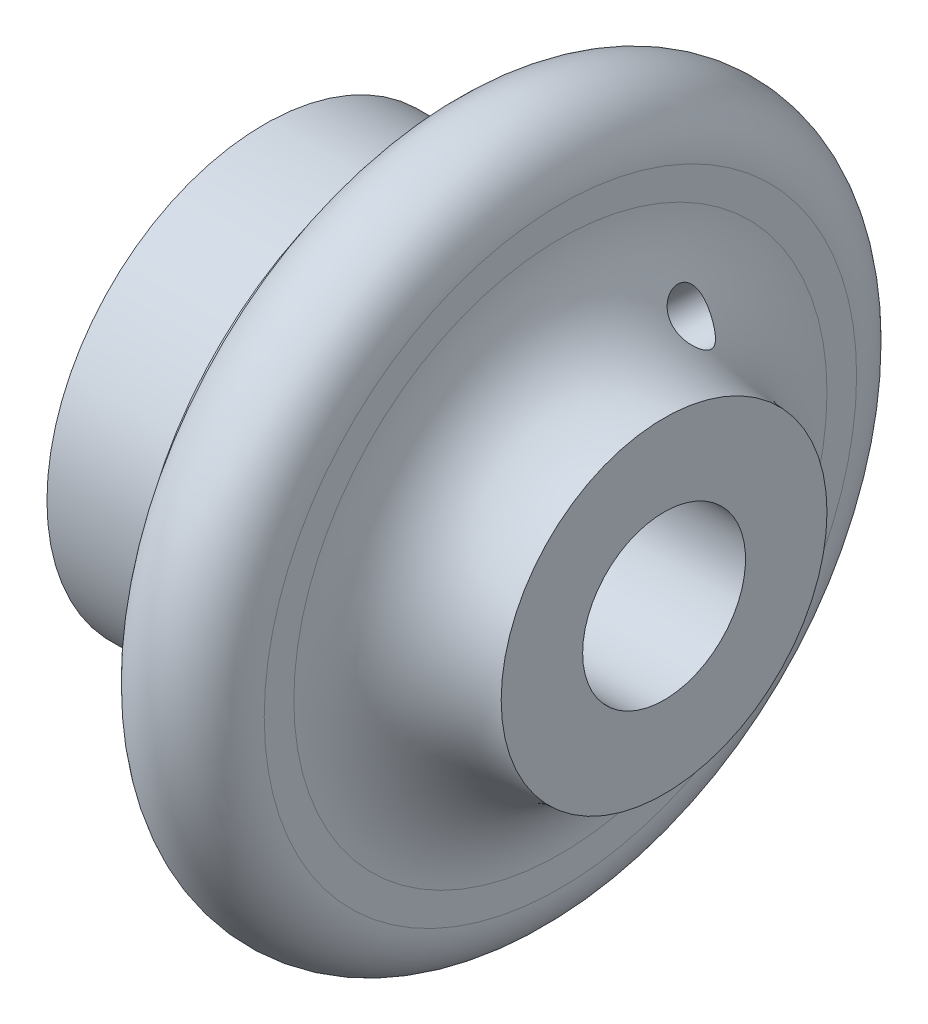
ISO-10303-21;
HEADER;
FILE_DESCRIPTION(('STEP AP214'),'2;1');
FILE_NAME('part.step','',(''),(''),'','','');
FILE_SCHEMA(('AUTOMOTIVE_DESIGN { 1 0 10303 214 1 1 1 1 }'));
ENDSEC;
DATA;
#1=APPLICATION_CONTEXT('core data for automotive mechanical design processes');
#2=APPLICATION_PROTOCOL_DEFINITION('international standard','automotive_design',2000,#1);
#3=PRODUCT_CONTEXT('',#1,'mechanical');
#4=PRODUCT('Part','Part','',(#3));
#5=PRODUCT_RELATED_PRODUCT_CATEGORY('part','',(#4));
#6=PRODUCT_DEFINITION_FORMATION('','',#4);
#7=PRODUCT_DEFINITION_CONTEXT('part definition',#1,'design');
#8=PRODUCT_DEFINITION('design','',#6,#7);
#9=PRODUCT_DEFINITION_SHAPE('','',#8);
#10=(LENGTH_UNIT() NAMED_UNIT(*) SI_UNIT(.MILLI.,.METRE.));
#11=(NAMED_UNIT(*) PLANE_ANGLE_UNIT() SI_UNIT($,.RADIAN.));
#12=(NAMED_UNIT(*) SI_UNIT($,.STERADIAN.) SOLID_ANGLE_UNIT());
#13=UNCERTAINTY_MEASURE_WITH_UNIT(LENGTH_MEASURE(1.E-05),#10,'distance_accuracy_value','');
#14=(GEOMETRIC_REPRESENTATION_CONTEXT(3) GLOBAL_UNCERTAINTY_ASSIGNED_CONTEXT((#13)) GLOBAL_UNIT_ASSIGNED_CONTEXT((#10,
#11,#12)) REPRESENTATION_CONTEXT('',''));
#15=CARTESIAN_POINT('',(0.,0.,0.));
#16=DIRECTION('',(0.,0.,1.));
#17=DIRECTION('',(1.,0.,0.));
#18=AXIS2_PLACEMENT_3D('',#15,#16,#17);
#19=CARTESIAN_POINT('',(0.,0.,0.));
#20=DIRECTION('',(-1.,0.,0.));
#21=DIRECTION('',(0.,0.,1.));
#22=AXIS2_PLACEMENT_3D('',#19,#20,#21);
#23=CYLINDRICAL_SURFACE('',#22,5.5);
#24=CARTESIAN_POINT('',(12.5844462418206,4.68197479093069,-2.88602010684083));
#25=CARTESIAN_POINT('',(12.5844073538159,4.68356159719157,-2.88344583971184));
#26=CARTESIAN_POINT('',(12.5843733260485,4.68514631308939,-2.88087021063567));
#27=CARTESIAN_POINT('',(12.5843149929826,4.6883114940928,-2.87571634191222));
#28=CARTESIAN_POINT('',(12.5842906873826,4.68989195932865,-2.87313810234836));
#29=CARTESIAN_POINT('',(12.5842517986359,4.6930486347125,-2.86797901966672));
#30=CARTESIAN_POINT('',(12.5842372152882,4.69462484494777,-2.86539817660388));
#31=CARTESIAN_POINT('',(12.5842177709226,4.69777300609527,-2.86023389398206));
#32=CARTESIAN_POINT('',(12.5842129098042,4.69934495705135,-2.85765045445021));
#33=CARTESIAN_POINT('',(12.5842129098042,4.7024845954034,-2.85248098594489));
#34=CARTESIAN_POINT('',(12.5842177709226,4.70405228279937,-2.84989495697142));
#35=CARTESIAN_POINT('',(12.5842372152882,4.70718338981338,-2.84472031664813));
#36=CARTESIAN_POINT('',(12.5842517986359,4.70874680938714,-2.8421317052719));
#37=CARTESIAN_POINT('',(12.5842906873826,4.71186937653598,-2.83695190720673));
#38=CARTESIAN_POINT('',(12.5843149929826,4.71342852402208,-2.83436072046567));
#39=CARTESIAN_POINT('',(12.5843733260485,4.71654254283953,-2.82917577876808));
#40=CARTESIAN_POINT('',(12.5844073538159,4.7180974140368,-2.8265820237344));
#41=CARTESIAN_POINT('',(12.5844462418206,4.71965011289547,-2.82398704172768));
#42=B_SPLINE_CURVE_WITH_KNOTS('',3,(#24,#25,#26,#27,#28,#29,#30,#31,#32,#33,#34,#35,#36,#37,#38,
#39,#40,#41),.UNSPECIFIED.,.F.,.F.,(4,2,2,2,2,2,2,2,4),(0.,0.00907285893690582,
0.018145436584956,0.0272178267022607,0.0362901230527381,0.0453624194032134,0.0544348095205164,
0.0635073871685684,0.0725802461054741),.UNSPECIFIED.);
#43=CARTESIAN_POINT('',(12.5844462418206,4.68197479093069,-2.88602010684082));
#44=VERTEX_POINT('',#43);
#45=CARTESIAN_POINT('',(12.5844462418206,4.71965011289547,-2.82398704172767));
#46=VERTEX_POINT('',#45);
#47=EDGE_CURVE('E11',#44,#46,#42,.T.);
#48=ORIENTED_EDGE('',*,*,#47,.T.);
#49=CARTESIAN_POINT('',(12.5844462418206,4.71965011289567,-2.82398704172733));
#50=CARTESIAN_POINT('',(12.5854407243061,4.74254446188668,-2.78573431152862));
#51=CARTESIAN_POINT('',(12.5882853164809,4.76494222822375,-2.74723618103867));
#52=CARTESIAN_POINT('',(12.5976312896019,4.8086131869956,-2.67005435174031));
#53=CARTESIAN_POINT('',(12.6041320860646,4.8298865585824,-2.63137068357183));
#54=CARTESIAN_POINT('',(12.620726193613,4.8711320529324,-2.55420911979931));
#55=CARTESIAN_POINT('',(12.6308102996465,4.89110735616467,-2.51573095101142));
#56=CARTESIAN_POINT('',(12.6544856142854,4.929721102333,-2.43919875473313));
#57=CARTESIAN_POINT('',(12.6680768440965,4.94835953718481,-2.40114472980877));
#58=CARTESIAN_POINT('',(12.7139696256757,5.00216415963477,-2.28807572565284));
#59=CARTESIAN_POINT('',(12.751405576397,5.03525720113143,-2.2140830078222));
#60=CARTESIAN_POINT('',(12.8387197184371,5.09564614568706,-2.07133381965437));
#61=CARTESIAN_POINT('',(12.8885997084428,5.12294120963757,-2.00257810816176));
#62=CARTESIAN_POINT('',(13.0005839574179,5.17261700326746,-1.87059685722941));
#63=CARTESIAN_POINT('',(13.0629609143852,5.19485893209347,-1.807550950142));
#64=CARTESIAN_POINT('',(13.1970813107076,5.23412805334419,-1.6904814208555));
#65=CARTESIAN_POINT('',(13.2688281183622,5.25115336308427,-1.6364610591783));
#66=CARTESIAN_POINT('',(13.4269159007863,5.28219590895888,-1.53348855892508));
#67=CARTESIAN_POINT('',(13.5139976658711,5.29575901791654,-1.48554162100251));
#68=CARTESIAN_POINT('',(13.694271640001,5.31855938831596,-1.40171395675281));
#69=CARTESIAN_POINT('',(13.7874672630901,5.32779420894784,-1.36584004185616));
#70=CARTESIAN_POINT('',(14.0256302253669,5.3466400021188,-1.29061383483072));
#71=CARTESIAN_POINT('',(14.1730832041622,5.35410874261513,-1.2585698453349));
#72=CARTESIAN_POINT('',(14.4714718393643,5.36348989762759,-1.21793558824287));
#73=CARTESIAN_POINT('',(14.6224153706091,5.36538819150762,-1.20940492836748));
#74=CARTESIAN_POINT('',(14.8720292179564,5.36472275638436,-1.21232008887631));
#75=CARTESIAN_POINT('',(14.9708353147491,5.36346835591175,-1.21790782388698));
#76=CARTESIAN_POINT('',(15.1676396061546,5.35903290017745,-1.23728398528866));
#77=CARTESIAN_POINT('',(15.2656374848967,5.35585112475237,-1.2510754769775));
#78=CARTESIAN_POINT('',(15.4602317269037,5.34748533839822,-1.28636192163183));
#79=CARTESIAN_POINT('',(15.5568266739119,5.3422994327766,-1.30786416290255));
#80=CARTESIAN_POINT('',(15.7479068927637,5.32971625968379,-1.35823430921419));
#81=CARTESIAN_POINT('',(15.8423927698676,5.32231963564535,-1.38710007073437));
#82=CARTESIAN_POINT('',(16.0117963420912,5.30653126036895,-1.44619596613093));
#83=CARTESIAN_POINT('',(16.0871687308587,5.29855985871259,-1.47524019609485));
#84=CARTESIAN_POINT('',(16.2356003112758,5.28062516131776,-1.53820373298429));
#85=CARTESIAN_POINT('',(16.3086599451774,5.27066224910002,-1.57212210090609));
#86=CARTESIAN_POINT('',(16.4517221239497,5.24841648792552,-1.64486135030861));
#87=CARTESIAN_POINT('',(16.5217315958327,5.2361392736725,-1.68367025012948));
#88=CARTESIAN_POINT('',(16.6580387546315,5.208804316836,-1.76642444373932));
#89=CARTESIAN_POINT('',(16.7243387608472,5.19374833754249,-1.81036647380045));
#90=CARTESIAN_POINT('',(16.8604888992262,5.15810196076647,-1.90974630829949));
#91=CARTESIAN_POINT('',(16.9296781904908,5.13704631207133,-1.9659359520254));
#92=CARTESIAN_POINT('',(17.0595082745278,5.08964334773907,-2.08558458112271));
#93=CARTESIAN_POINT('',(17.1201575940681,5.06330137492539,-2.14903619930369));
#94=CARTESIAN_POINT('',(17.2175975773092,5.01055711568578,-2.26883925570276));
#95=CARTESIAN_POINT('',(17.2567172126369,4.98537019432894,-2.32381119960375));
#96=CARTESIAN_POINT('',(17.3249577565875,4.93067789675642,-2.43770014900088));
#97=CARTESIAN_POINT('',(17.3540947518428,4.90117957868758,-2.49661062283711));
#98=CARTESIAN_POINT('',(17.3957312984784,4.84352337406969,-2.60641871613979));
#99=CARTESIAN_POINT('',(17.4102583921115,4.8160460098674,-2.65689798890184));
#100=CARTESIAN_POINT('',(17.4295627463694,4.75866912467721,-2.75834255126725));
#101=CARTESIAN_POINT('',(17.4343470414647,4.7287713674841,-2.80930746349937));
#102=CARTESIAN_POINT('',(17.4337212038405,4.66733029934673,-2.91024439574638));
#103=CARTESIAN_POINT('',(17.4283003173993,4.63578528666306,-2.96021531225991));
#104=CARTESIAN_POINT('',(17.4077605000483,4.57207278270287,-3.05770374594199));
#105=CARTESIAN_POINT('',(17.3926344122568,4.53990484905882,-3.10521942458722));
#106=CARTESIAN_POINT('',(17.3491434281356,4.46800396848911,-3.20808137373013));
#107=CARTESIAN_POINT('',(17.318440742007,4.42835161157315,-3.26248809723255));
#108=CARTESIAN_POINT('',(17.2467397765893,4.35070300336199,-3.36534715657028));
#109=CARTESIAN_POINT('',(17.2057224299425,4.31270997381622,-3.41378821464248));
#110=CARTESIAN_POINT('',(17.0940675330864,4.22105904323189,-3.5270774386596));
#111=CARTESIAN_POINT('',(17.0187418120375,4.16880131514995,-3.58840091255295));
#112=CARTESIAN_POINT('',(16.8569031184252,4.07013299084318,-3.69994331367482));
#113=CARTESIAN_POINT('',(16.7703634815024,4.02373686895314,-3.75013497468643));
#114=CARTESIAN_POINT('',(16.608222566018,3.94589661763441,-3.83175906184658));
#115=CARTESIAN_POINT('',(16.5340058821347,3.91333549502333,-3.86492855115091));
#116=CARTESIAN_POINT('',(16.3818639172932,3.85206858908989,-3.92599561868137));
#117=CARTESIAN_POINT('',(16.3039365180111,3.82336504454768,-3.95389013932186));
#118=CARTESIAN_POINT('',(16.1451417608063,3.76987277974414,-4.00492505765584));
#119=CARTESIAN_POINT('',(16.0642711296054,3.74508859283687,-4.0280599592716));
#120=CARTESIAN_POINT('',(15.900263299841,3.69959051771514,-4.06988749324491));
#121=CARTESIAN_POINT('',(15.8171258120193,3.67887715174493,-4.08857955569647));
#122=CARTESIAN_POINT('',(15.6453699171905,3.64088592710593,-4.12245385616322));
#123=CARTESIAN_POINT('',(15.5566714167421,3.62379965429547,-4.13744515796642));
#124=CARTESIAN_POINT('',(15.377809670933,3.59454441243917,-4.16288669899947));
#125=CARTESIAN_POINT('',(15.2876462171633,3.58237614953061,-4.17333628613745));
#126=CARTESIAN_POINT('',(15.1064604414522,3.56333056665199,-4.18961029505262));
#127=CARTESIAN_POINT('',(15.0154394600434,3.5564460463476,-4.1954410114707));
#128=CARTESIAN_POINT('',(14.8329672721542,3.54836254181784,-4.20227861509101));
#129=CARTESIAN_POINT('',(14.7415160537121,3.54716371661645,-4.20328536737113));
#130=CARTESIAN_POINT('',(14.5091982789801,3.55194568514114,-4.1992545794946));
#131=CARTESIAN_POINT('',(14.3684200818097,3.56217109466837,-4.19064436742053));
#132=CARTESIAN_POINT('',(14.0906989088275,3.59902653966737,-4.15904115718362));
#133=CARTESIAN_POINT('',(13.9537503442987,3.62563120876845,-4.13607039818611));
#134=CARTESIAN_POINT('',(13.7156172363779,3.68902491135144,-4.07951944203249));
#135=CARTESIAN_POINT('',(13.6128507108483,3.72261391399555,-4.04907399466686));
#136=CARTESIAN_POINT('',(13.4160114492368,3.80056669202124,-3.97599632134747));
#137=CARTESIAN_POINT('',(13.3219353570598,3.8449262837709,-3.93336882614486));
#138=CARTESIAN_POINT('',(13.1455624286358,3.94348709521593,-3.83455348667814));
#139=CARTESIAN_POINT('',(13.0633692154675,3.99776651724371,-3.77825663117143));
#140=CARTESIAN_POINT('',(12.9157257184455,4.11321107427591,-3.6522240104493));
#141=CARTESIAN_POINT('',(12.8502670713593,4.17437274772361,-3.58249498873922));
#142=CARTESIAN_POINT('',(12.7472791914361,4.29096155663834,-3.44162792215943));
#143=CARTESIAN_POINT('',(12.7071161547324,4.34598477115188,-3.37206848739146));
#144=CARTESIAN_POINT('',(12.6431803091541,4.45572463368199,-3.2256517069475));
#145=CARTESIAN_POINT('',(12.61937727361,4.51044166079686,-3.14880812010788));
#146=CARTESIAN_POINT('',(12.5984171794697,4.58393589319151,-3.03954882909907));
#147=CARTESIAN_POINT('',(12.5938939428191,4.60391367566804,-3.00920440627902));
#148=CARTESIAN_POINT('',(12.5873213441169,4.64334723148255,-2.9479900453796));
#149=CARTESIAN_POINT('',(12.5852676688254,4.66280385675209,-2.91712111931938));
#150=CARTESIAN_POINT('',(12.5844462418206,4.68197479093048,-2.88602010684118));
#151=B_SPLINE_CURVE_WITH_KNOTS('',3,(#49,#50,#51,#52,#53,#54,#55,#56,#57,#58,#59,#60,#61,#62,
#63,#64,#65,#66,#67,#68,#69,#70,#71,#72,#73,#74,#75,#76,#77,#78,#79,#80,#81,#82,#83,#84,#85,#86,
#87,#88,#89,#90,#91,#92,#93,#94,#95,#96,#97,#98,#99,#100,#101,#102,#103,#104,#105,#106,#107,
#108,#109,#110,#111,#112,#113,#114,#115,#116,#117,#118,#119,#120,#121,#122,#123,#124,#125,#126,
#127,#128,#129,#130,#131,#132,#133,#134,#135,#136,#137,#138,#139,#140,#141,#142,#143,#144,#145,
#146,#147,#148,#149,#150),.UNSPECIFIED.,.F.,.F.,(4,2,2,2,2,2,2,2,2,2,2,2,2,2,2,2,2,2,2,2,2,2,2,
2,2,2,2,2,2,2,2,2,2,2,2,2,2,2,2,2,2,2,2,2,2,2,2,2,2,2,4),(0.,0.133728255632037,
0.267435139445308,0.400801001800391,0.534167670572913,0.800659349001152,1.06718956902301,
1.34033559767601,1.61358008928883,1.91342242423688,2.21343364353949,2.66418023238913,
3.11606844489363,3.41264609484604,3.70933462941089,4.00630434039949,4.30318770195882,
4.54650425298857,4.78977399171753,5.03245891020145,5.27499035701464,5.54908430776802,
5.82290261777354,6.03821807598234,6.25318491157672,6.430253501042,6.60719419850227,
6.78432145179559,6.9615794739418,7.18233346706536,7.40349857808257,7.73255939652835,
8.06241752571737,8.32478758186426,8.58730925527613,8.85013238978075,9.11298921979786,
9.38742786595455,9.66190590255107,9.93600923123951,10.2101202263162,10.6328346384482,
11.0548960387191,11.3905514537562,11.7260766977814,12.0643710610348,12.4024960270249,
12.6930472819851,12.9830602620814,13.0928220368933,13.2023918263125),.UNSPECIFIED.);
#152=EDGE_CURVE('E51',#46,#44,#151,.T.);
#153=ORIENTED_EDGE('',*,*,#152,.T.);
#154=EDGE_LOOP('',(#48,#153));
#155=FACE_BOUND('',#154,.T.);
#156=CARTESIAN_POINT('',(27.,0.,0.));
#157=DIRECTION('',(-1.,0.,0.));
#158=DIRECTION('',(0.,0.,1.));
#159=AXIS2_PLACEMENT_3D('',#156,#157,#158);
#160=CIRCLE('',#159,5.5);
#161=CARTESIAN_POINT('',(27.,0.,5.5));
#162=VERTEX_POINT('',#161);
#163=EDGE_CURVE('E60',#162,#162,#160,.T.);
#164=ORIENTED_EDGE('',*,*,#163,.F.);
#165=EDGE_LOOP('',(#164));
#166=FACE_BOUND('',#165,.T.);
#167=CARTESIAN_POINT('',(0.,0.,0.));
#168=DIRECTION('',(-1.,0.,0.));
#169=DIRECTION('',(0.,0.,1.));
#170=AXIS2_PLACEMENT_3D('',#167,#168,#169);
#171=CIRCLE('',#170,5.5);
#172=CARTESIAN_POINT('',(0.,0.,5.5));
#173=VERTEX_POINT('',#172);
#174=EDGE_CURVE('E45',#173,#173,#171,.T.);
#175=ORIENTED_EDGE('',*,*,#174,.T.);
#176=EDGE_LOOP('',(#175));
#177=FACE_BOUND('',#176,.T.);
#178=ADVANCED_FACE('F34',(#155,#166,#177),#23,.F.);
#179=CARTESIAN_POINT('',(0.,5.5,0.));
#180=DIRECTION('',(1.,0.,0.));
#181=DIRECTION('',(0.,0.,-1.));
#182=AXIS2_PLACEMENT_3D('',#179,#180,#181);
#183=PLANE('',#182);
#184=ORIENTED_EDGE('',*,*,#174,.F.);
#185=EDGE_LOOP('',(#184));
#186=FACE_BOUND('',#185,.T.);
#187=CARTESIAN_POINT('',(0.,0.,0.));
#188=DIRECTION('',(-1.,0.,0.));
#189=DIRECTION('',(0.,0.,1.));
#190=AXIS2_PLACEMENT_3D('',#187,#188,#189);
#191=CIRCLE('',#190,14.67);
#192=CARTESIAN_POINT('',(0.,0.,14.67));
#193=VERTEX_POINT('',#192);
#194=EDGE_CURVE('E129',#193,#193,#191,.T.);
#195=ORIENTED_EDGE('',*,*,#194,.T.);
#196=EDGE_LOOP('',(#195));
#197=FACE_BOUND('',#196,.T.);
#198=ADVANCED_FACE('F117',(#186,#197),#183,.F.);
#199=CARTESIAN_POINT('',(0.,0.,0.));
#200=DIRECTION('',(-1.,0.,0.));
#201=DIRECTION('',(0.,0.,1.));
#202=AXIS2_PLACEMENT_3D('',#199,#200,#201);
#203=CYLINDRICAL_SURFACE('',#202,14.67);
#204=ORIENTED_EDGE('',*,*,#194,.F.);
#205=EDGE_LOOP('',(#204));
#206=FACE_BOUND('',#205,.T.);
#207=CARTESIAN_POINT('',(8.,0.,0.));
#208=DIRECTION('',(-1.,0.,0.));
#209=DIRECTION('',(0.,0.,1.));
#210=AXIS2_PLACEMENT_3D('',#207,#208,#209);
#211=CIRCLE('',#210,14.67);
#212=CARTESIAN_POINT('',(8.,0.,14.67));
#213=VERTEX_POINT('',#212);
#214=EDGE_CURVE('E130',#213,#213,#211,.T.);
#215=ORIENTED_EDGE('',*,*,#214,.T.);
#216=EDGE_LOOP('',(#215));
#217=FACE_BOUND('',#216,.T.);
#218=ADVANCED_FACE('F114',(#206,#217),#203,.T.);
#219=CARTESIAN_POINT('',(8.,14.67,0.));
#220=DIRECTION('',(-1.,0.,0.));
#221=DIRECTION('',(0.,0.,1.));
#222=AXIS2_PLACEMENT_3D('',#219,#220,#221);
#223=PLANE('',#222);
#224=ORIENTED_EDGE('',*,*,#214,.F.);
#225=EDGE_LOOP('',(#224));
#226=FACE_BOUND('',#225,.T.);
#227=CARTESIAN_POINT('',(8.,0.,0.));
#228=DIRECTION('',(-1.,0.,0.));
#229=DIRECTION('',(0.,0.,1.));
#230=AXIS2_PLACEMENT_3D('',#227,#228,#229);
#231=CIRCLE('',#230,13.17);
#232=CARTESIAN_POINT('',(8.,0.,13.17));
#233=VERTEX_POINT('',#232);
#234=EDGE_CURVE('E132',#233,#233,#231,.T.);
#235=ORIENTED_EDGE('',*,*,#234,.T.);
#236=EDGE_LOOP('',(#235));
#237=FACE_BOUND('',#236,.T.);
#238=ADVANCED_FACE('F110',(#226,#237),#223,.F.);
#239=CARTESIAN_POINT('',(0.,0.,0.));
#240=DIRECTION('',(-1.,0.,0.));
#241=DIRECTION('',(0.,0.,1.));
#242=AXIS2_PLACEMENT_3D('',#239,#240,#241);
#243=CYLINDRICAL_SURFACE('',#242,13.17);
#244=ORIENTED_EDGE('',*,*,#234,.F.);
#245=EDGE_LOOP('',(#244));
#246=FACE_BOUND('',#245,.T.);
#247=CARTESIAN_POINT('',(11.,0.,0.));
#248=DIRECTION('',(-1.,0.,0.));
#249=DIRECTION('',(0.,0.,1.));
#250=AXIS2_PLACEMENT_3D('',#247,#248,#249);
#251=CIRCLE('',#250,13.17);
#252=CARTESIAN_POINT('',(11.,0.,13.17));
#253=VERTEX_POINT('',#252);
#254=EDGE_CURVE('E137',#253,#253,#251,.T.);
#255=ORIENTED_EDGE('',*,*,#254,.T.);
#256=EDGE_LOOP('',(#255));
#257=FACE_BOUND('',#256,.T.);
#258=ADVANCED_FACE('F106',(#246,#257),#243,.T.);
#259=CARTESIAN_POINT('',(11.,13.17,0.));
#260=DIRECTION('',(1.,0.,0.));
#261=DIRECTION('',(0.,0.,-1.));
#262=AXIS2_PLACEMENT_3D('',#259,#260,#261);
#263=PLANE('',#262);
#264=ORIENTED_EDGE('',*,*,#254,.F.);
#265=EDGE_LOOP('',(#264));
#266=FACE_BOUND('',#265,.T.);
#267=CARTESIAN_POINT('',(11.,0.,0.));
#268=DIRECTION('',(-1.,0.,0.));
#269=DIRECTION('',(0.,0.,1.));
#270=AXIS2_PLACEMENT_3D('',#267,#268,#269);
#271=CIRCLE('',#270,20.);
#272=CARTESIAN_POINT('',(11.,0.,20.));
#273=VERTEX_POINT('',#272);
#274=EDGE_CURVE('E140',#273,#273,#271,.T.);
#275=ORIENTED_EDGE('',*,*,#274,.T.);
#276=EDGE_LOOP('',(#275));
#277=FACE_BOUND('',#276,.T.);
#278=ADVANCED_FACE('F102',(#266,#277),#263,.F.);
#279=CARTESIAN_POINT('',(0.,0.,0.));
#280=DIRECTION('',(-1.,0.,0.));
#281=DIRECTION('',(0.,0.,1.));
#282=AXIS2_PLACEMENT_3D('',#279,#280,#281);
#283=CYLINDRICAL_SURFACE('',#282,20.);
#284=ORIENTED_EDGE('',*,*,#274,.F.);
#285=EDGE_LOOP('',(#284));
#286=FACE_BOUND('',#285,.T.);
#287=CARTESIAN_POINT('',(12.,0.,0.));
#288=DIRECTION('',(-1.,0.,0.));
#289=DIRECTION('',(0.,0.,1.));
#290=AXIS2_PLACEMENT_3D('',#287,#288,#289);
#291=CIRCLE('',#290,20.);
#292=CARTESIAN_POINT('',(12.,0.,20.));
#293=VERTEX_POINT('',#292);
#294=EDGE_CURVE('E143',#293,#293,#291,.T.);
#295=ORIENTED_EDGE('',*,*,#294,.T.);
#296=EDGE_LOOP('',(#295));
#297=FACE_BOUND('',#296,.T.);
#298=ADVANCED_FACE('F98',(#286,#297),#283,.T.);
#299=CARTESIAN_POINT('',(16.,0.,0.));
#300=DIRECTION('',(-1.,0.,0.));
#301=DIRECTION('',(0.,0.,1.));
#302=AXIS2_PLACEMENT_3D('',#299,#300,#301);
#303=TOROIDAL_SURFACE('',#302,20.,4.);
#304=ORIENTED_EDGE('',*,*,#294,.F.);
#305=EDGE_LOOP('',(#304));
#306=FACE_BOUND('',#305,.T.);
#307=CARTESIAN_POINT('',(20.,0.,0.));
#308=DIRECTION('',(-1.,0.,0.));
#309=DIRECTION('',(0.,0.,1.));
#310=AXIS2_PLACEMENT_3D('',#307,#308,#309);
#311=CIRCLE('',#310,20.);
#312=CARTESIAN_POINT('',(20.,0.,20.));
#313=VERTEX_POINT('',#312);
#314=EDGE_CURVE('E146',#313,#313,#311,.T.);
#315=ORIENTED_EDGE('',*,*,#314,.T.);
#316=EDGE_LOOP('',(#315));
#317=FACE_BOUND('',#316,.T.);
#318=ADVANCED_FACE('F94',(#306,#317),#303,.T.);
#319=CARTESIAN_POINT('',(20.,20.,0.));
#320=DIRECTION('',(-1.,0.,0.));
#321=DIRECTION('',(0.,0.,1.));
#322=AXIS2_PLACEMENT_3D('',#319,#320,#321);
#323=PLANE('',#322);
#324=ORIENTED_EDGE('',*,*,#314,.F.);
#325=EDGE_LOOP('',(#324));
#326=FACE_BOUND('',#325,.T.);
#327=CARTESIAN_POINT('',(20.,0.,0.));
#328=DIRECTION('',(-1.,0.,0.));
#329=DIRECTION('',(0.,0.,1.));
#330=AXIS2_PLACEMENT_3D('',#327,#328,#329);
#331=CIRCLE('',#330,18.);
#332=CARTESIAN_POINT('',(20.,0.,18.));
#333=VERTEX_POINT('',#332);
#334=EDGE_CURVE('E149',#333,#333,#331,.T.);
#335=ORIENTED_EDGE('',*,*,#334,.T.);
#336=EDGE_LOOP('',(#335));
#337=FACE_BOUND('',#336,.T.);
#338=ADVANCED_FACE('F90',(#326,#337),#323,.F.);
#339=CARTESIAN_POINT('',(27.,0.,0.));
#340=DIRECTION('',(-1.,0.,0.));
#341=DIRECTION('',(0.,0.,1.));
#342=AXIS2_PLACEMENT_3D('',#339,#340,#341);
#343=TOROIDAL_SURFACE('',#342,18.,7.);
#344=CARTESIAN_POINT('',(22.3627550426948,11.6930033143286,-5.0988146094378));
#345=CARTESIAN_POINT('',(22.2929130152295,11.7541318673025,-5.11316519051133));
#346=CARTESIAN_POINT('',(22.2235735455433,11.814065943,-5.13539065155136));
#347=CARTESIAN_POINT('',(22.0880577270952,11.9297749898639,-5.19506429237627));
#348=CARTESIAN_POINT('',(22.0218819685569,11.9855491860394,-5.23251530035756));
#349=CARTESIAN_POINT('',(21.8944290653147,12.09111014157,-5.32132325674116));
#350=CARTESIAN_POINT('',(21.8331466124927,12.1409034192676,-5.37266486413076));
#351=CARTESIAN_POINT('',(21.7165668531752,12.232904780077,-5.48748522278508));
#352=CARTESIAN_POINT('',(21.6612705327666,12.2751116142388,-5.55096596896225));
#353=CARTESIAN_POINT('',(21.5562348461716,12.3512707810565,-5.68948215894632));
#354=CARTESIAN_POINT('',(21.5066438086438,12.3850219571525,-5.76474032633294));
#355=CARTESIAN_POINT('',(21.4148349995224,12.4416566852468,-5.92340797123462));
#356=CARTESIAN_POINT('',(21.3726190421181,12.4645375656442,-6.00681944652716));
#357=CARTESIAN_POINT('',(21.2939704598981,12.4989905451462,-6.18333908809589));
#358=CARTESIAN_POINT('',(21.2578918301497,12.5099959221521,-6.27671651554595));
#359=CARTESIAN_POINT('',(21.1940858086009,12.5176415944227,-6.46686776141383));
#360=CARTESIAN_POINT('',(21.166358749779,12.5142813170079,-6.56364171507995));
#361=CARTESIAN_POINT('',(21.1193247087029,12.4924075946064,-6.75755706492909));
#362=CARTESIAN_POINT('',(21.1000183533133,12.4738930217797,-6.85469848792493));
#363=CARTESIAN_POINT('',(21.0699160368883,12.421491729552,-7.0461070840771));
#364=CARTESIAN_POINT('',(21.0591171521009,12.387610297574,-7.14037523397157));
#365=CARTESIAN_POINT('',(21.0463658705284,12.3068470808778,-7.31890675237409));
#366=CARTESIAN_POINT('',(21.0440528920036,12.2605872593902,-7.40342606056598));
#367=CARTESIAN_POINT('',(21.0472848856667,12.1558213845112,-7.56432181714955));
#368=CARTESIAN_POINT('',(21.0528288235882,12.0973169438376,-7.64069933588474));
#369=CARTESIAN_POINT('',(21.0715164121358,11.9715092745076,-7.78154101395338));
#370=CARTESIAN_POINT('',(21.084480184316,11.90444251903,-7.84624107238766));
#371=CARTESIAN_POINT('',(21.1178070578462,11.7627340611204,-7.96446429779433));
#372=CARTESIAN_POINT('',(21.13817120375,11.6880912904154,-8.01798588525882));
#373=CARTESIAN_POINT('',(21.1869230033808,11.5314734328571,-8.11430375050379));
#374=CARTESIAN_POINT('',(21.2155226929274,11.4493500454717,-8.15675107147086));
#375=CARTESIAN_POINT('',(21.280425669056,11.282385752847,-8.22834819590483));
#376=CARTESIAN_POINT('',(21.3167310498919,11.197544114174,-8.25749437758901));
#377=CARTESIAN_POINT('',(21.3986347975136,11.0243384122901,-8.30319014922925));
#378=CARTESIAN_POINT('',(21.4445574631451,10.935974944587,-8.31916398941067));
#379=CARTESIAN_POINT('',(21.5444352959055,10.7623903723806,-8.33641546710748));
#380=CARTESIAN_POINT('',(21.5983906141429,10.6771693270296,-8.33769282812034));
#381=CARTESIAN_POINT('',(21.7136220642847,10.5132616315315,-8.3258026507203));
#382=CARTESIAN_POINT('',(21.77487551774,10.434555963766,-8.3126788705609));
#383=CARTESIAN_POINT('',(21.9037839664327,10.2864668276858,-8.27260420457239));
#384=CARTESIAN_POINT('',(21.9714364030621,10.2170796600357,-8.24565882635224));
#385=CARTESIAN_POINT('',(22.1081615874942,10.0933103647388,-8.18049359266807));
#386=CARTESIAN_POINT('',(22.1770158754136,10.0383738231533,-8.1428671650279));
#387=CARTESIAN_POINT('',(22.3170639962203,9.94113807974082,-8.05712948198938));
#388=CARTESIAN_POINT('',(22.3882575078499,9.89883715058548,-8.00901966126079));
#389=CARTESIAN_POINT('',(22.5289802662106,9.82867020097369,-7.90497906329147));
#390=CARTESIAN_POINT('',(22.5985088464756,9.80048495760171,-7.84926137749913));
#391=CARTESIAN_POINT('',(22.7353453429817,9.75719380709235,-7.73051009456862));
#392=CARTESIAN_POINT('',(22.8026528176243,9.74209048600071,-7.66747505372094));
#393=CARTESIAN_POINT('',(22.9352462985622,9.72419482096979,-7.53283716371904));
#394=CARTESIAN_POINT('',(23.0003603792463,9.72188816715917,-7.46100087087831));
#395=CARTESIAN_POINT('',(23.1233365008486,9.7299587345244,-7.31200418140629));
#396=CARTESIAN_POINT('',(23.1811958358514,9.74034067293656,-7.23484181476612));
#397=CARTESIAN_POINT('',(23.2897604414127,9.77338740529128,-7.07262821779498));
#398=CARTESIAN_POINT('',(23.3399995553465,9.79660844745048,-6.98737655855921));
#399=CARTESIAN_POINT('',(23.4272090476321,9.85415509963979,-6.8138750701747));
#400=CARTESIAN_POINT('',(23.4641825582865,9.88847808461103,-6.72562595418622));
#401=CARTESIAN_POINT('',(23.5218571700975,9.96561793384037,-6.55016858424473));
#402=CARTESIAN_POINT('',(23.5429170939901,10.008218431807,-6.46298393462808));
#403=CARTESIAN_POINT('',(23.5686743951789,10.1006466354667,-6.29005634428139));
#404=CARTESIAN_POINT('',(23.5733793568954,10.1504709800162,-6.20431275364099));
#405=CARTESIAN_POINT('',(23.5663254798761,10.2523612418485,-6.04217870763452));
#406=CARTESIAN_POINT('',(23.5555615864271,10.3041007399849,-5.96553735445493));
#407=CARTESIAN_POINT('',(23.5200505563507,10.4111423798684,-5.81823809088938));
#408=CARTESIAN_POINT('',(23.4953035057222,10.466444499703,-5.7475801437075));
#409=CARTESIAN_POINT('',(23.4331228757551,10.579930519338,-5.61397558597928));
#410=CARTESIAN_POINT('',(23.3956230261127,10.6381280886415,-5.55107164433617));
#411=CARTESIAN_POINT('',(23.3098526815989,10.756507562672,-5.4351649040944));
#412=CARTESIAN_POINT('',(23.2615725501688,10.8166912014808,-5.38217104254497));
#413=CARTESIAN_POINT('',(23.152972146469,10.9424360613588,-5.28467408653458));
#414=CARTESIAN_POINT('',(23.0920771959536,11.0080941873603,-5.24093634216542));
#415=CARTESIAN_POINT('',(22.9631870770082,11.1403939817505,-5.16829743194943));
#416=CARTESIAN_POINT('',(22.895209095631,11.2070329472827,-5.13936131444322));
#417=CARTESIAN_POINT('',(22.7992618205226,11.2982730894805,-5.11084551460198));
#418=CARTESIAN_POINT('',(22.7731747343416,11.3228105545213,-5.10427280936153));
#419=CARTESIAN_POINT('',(22.7287757913147,11.3641831680833,-5.09506678621334));
#420=CARTESIAN_POINT('',(22.7105890891317,11.3810224774441,-5.09184442516828));
#421=CARTESIAN_POINT('',(22.6382795621444,11.4475954626919,-5.08121582154527));
#422=CARTESIAN_POINT('',(22.583418838167,11.4972706287908,-5.07794775527835));
#423=CARTESIAN_POINT('',(22.4731867850608,11.5958800217322,-5.08108231273752));
#424=CARTESIAN_POINT('',(22.4178147465889,11.6448128458046,-5.08750138195441));
#425=CARTESIAN_POINT('',(22.3627550426948,11.6930033143286,-5.0988146094378));
#426=B_SPLINE_CURVE_WITH_KNOTS('',3,(#344,#345,#346,#347,#348,#349,#350,#351,#352,#353,#354,
#355,#356,#357,#358,#359,#360,#361,#362,#363,#364,#365,#366,#367,#368,#369,#370,#371,#372,#373,
#374,#375,#376,#377,#378,#379,#380,#381,#382,#383,#384,#385,#386,#387,#388,#389,#390,#391,#392,
#393,#394,#395,#396,#397,#398,#399,#400,#401,#402,#403,#404,#405,#406,#407,#408,#409,#410,#411,
#412,#413,#414,#415,#416,#417,#418,#419,#420,#421,#422,#423,#424,#425),.UNSPECIFIED.,.T.,.F.,(4,
2,2,2,2,2,2,2,2,2,2,2,2,2,2,2,2,2,2,2,2,2,2,2,2,2,2,2,2,2,2,2,2,2,2,2,2,2,2,2,4),(0.,
0.281497844385117,0.563048001847759,0.844288470993416,1.12557519820053,1.41302600668711,
1.70054742567614,2.00125414166925,2.30197284529704,2.60271393158545,2.90335161740956,
3.19105619114579,3.47872289562947,3.75969445631911,4.0407056912191,4.32972192297504,
4.61881680441164,4.91996290033499,5.2211146620725,5.52135389359705,5.82147357909093,
6.10740063380781,6.39328858347956,6.67238084527642,6.95152826569007,7.24120162120135,
7.53098270130491,7.83443187887083,8.1378093581423,8.43412339349,8.73029999836072,
9.00825769791938,9.28621368800765,9.56563673408303,9.84531056523957,10.1429727439088,
10.4399287584119,10.5491073367202,10.6240738123194,10.8456150705197,11.0675328544264),.UNSPECIFIED.);
#427=CARTESIAN_POINT('',(22.3627550426948,11.6930033143286,-5.0988146094378));
#428=VERTEX_POINT('',#427);
#429=EDGE_CURVE('E57',#428,#428,#426,.T.);
#430=ORIENTED_EDGE('',*,*,#429,.T.);
#431=EDGE_LOOP('',(#430));
#432=FACE_BOUND('',#431,.T.);
#433=ORIENTED_EDGE('',*,*,#334,.F.);
#434=EDGE_LOOP('',(#433));
#435=FACE_BOUND('',#434,.T.);
#436=CARTESIAN_POINT('',(27.,0.,0.));
#437=DIRECTION('',(-1.,0.,0.));
#438=DIRECTION('',(0.,0.,1.));
#439=AXIS2_PLACEMENT_3D('',#436,#437,#438);
#440=CIRCLE('',#439,11.);
#441=CARTESIAN_POINT('',(27.,0.,11.));
#442=VERTEX_POINT('',#441);
#443=EDGE_CURVE('E152',#442,#442,#440,.T.);
#444=ORIENTED_EDGE('',*,*,#443,.T.);
#445=EDGE_LOOP('',(#444));
#446=FACE_BOUND('',#445,.T.);
#447=ADVANCED_FACE('F86',(#432,#435,#446),#343,.F.);
#448=CARTESIAN_POINT('',(27.,11.,0.));
#449=DIRECTION('',(-1.,0.,0.));
#450=DIRECTION('',(0.,0.,1.));
#451=AXIS2_PLACEMENT_3D('',#448,#449,#450);
#452=PLANE('',#451);
#453=ORIENTED_EDGE('',*,*,#443,.F.);
#454=EDGE_LOOP('',(#453));
#455=FACE_BOUND('',#454,.T.);
#456=ORIENTED_EDGE('',*,*,#163,.T.);
#457=EDGE_LOOP('',(#456));
#458=FACE_BOUND('',#457,.T.);
#459=ADVANCED_FACE('F79',(#455,#458),#452,.F.);
#460=CARTESIAN_POINT('',(22.1541795966488,11.0672039487228,-6.72158422701537));
#461=DIRECTION('',(0.692260057621603,0.616801149457592,-0.374609602986266));
#462=DIRECTION('',(-0.665242341442513,0.746627502274115,0.));
#463=AXIS2_PLACEMENT_3D('',#460,#461,#462);
#464=CYLINDRICAL_SURFACE('',#463,1.75);
#465=ORIENTED_EDGE('',*,*,#429,.F.);
#466=EDGE_LOOP('',(#465));
#467=FACE_BOUND('',#466,.T.);
#468=ORIENTED_EDGE('',*,*,#47,.F.);
#469=ORIENTED_EDGE('',*,*,#152,.F.);
#470=EDGE_LOOP('',(#468,#469));
#471=FACE_BOUND('',#470,.T.);
#472=ADVANCED_FACE('F52',(#467,#471),#464,.F.);
#473=CLOSED_SHELL('',(#178,#198,#218,#238,#258,#278,#298,#318,#338,#447,#459,#472));
#474=MANIFOLD_SOLID_BREP('B2',#473);
#475=ADVANCED_BREP_SHAPE_REPRESENTATION('',(#18,#474),#14);
#476=SHAPE_DEFINITION_REPRESENTATION(#9,#475);
ENDSEC;
END-ISO-10303-21;
